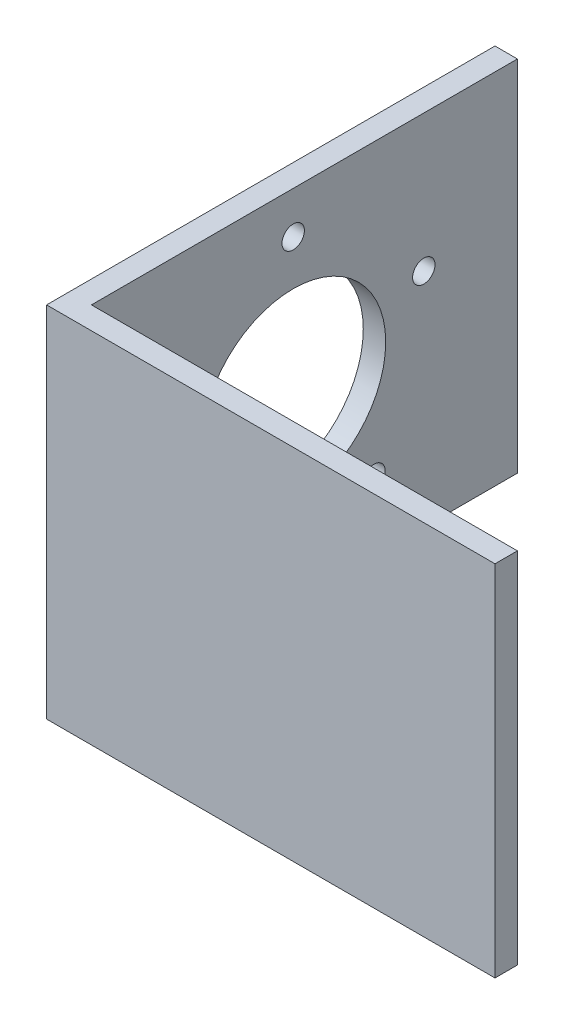
ISO-10303-21;
HEADER;
FILE_DESCRIPTION(('STEP AP214'),'2;1');
FILE_NAME('part.step','',(''),(''),'','','');
FILE_SCHEMA(('AUTOMOTIVE_DESIGN { 1 0 10303 214 1 1 1 1 }'));
ENDSEC;
DATA;
#1=APPLICATION_CONTEXT('core data for automotive mechanical design processes');
#2=APPLICATION_PROTOCOL_DEFINITION('international standard','automotive_design',2000,#1);
#3=PRODUCT_CONTEXT('',#1,'mechanical');
#4=PRODUCT('Part','Part','',(#3));
#5=PRODUCT_RELATED_PRODUCT_CATEGORY('part','',(#4));
#6=PRODUCT_DEFINITION_FORMATION('','',#4);
#7=PRODUCT_DEFINITION_CONTEXT('part definition',#1,'design');
#8=PRODUCT_DEFINITION('design','',#6,#7);
#9=PRODUCT_DEFINITION_SHAPE('','',#8);
#10=(LENGTH_UNIT() NAMED_UNIT(*) SI_UNIT(.MILLI.,.METRE.));
#11=(NAMED_UNIT(*) PLANE_ANGLE_UNIT() SI_UNIT($,.RADIAN.));
#12=(NAMED_UNIT(*) SI_UNIT($,.STERADIAN.) SOLID_ANGLE_UNIT());
#13=UNCERTAINTY_MEASURE_WITH_UNIT(LENGTH_MEASURE(1.E-05),#10,'distance_accuracy_value','');
#14=(GEOMETRIC_REPRESENTATION_CONTEXT(3) GLOBAL_UNCERTAINTY_ASSIGNED_CONTEXT((#13)) GLOBAL_UNIT_ASSIGNED_CONTEXT((#10,
#11,#12)) REPRESENTATION_CONTEXT('',''));
#15=CARTESIAN_POINT('',(0.,0.,0.));
#16=DIRECTION('',(0.,0.,1.));
#17=DIRECTION('',(1.,0.,0.));
#18=AXIS2_PLACEMENT_3D('',#15,#16,#17);
#19=CARTESIAN_POINT('',(0.,50.8,63.5));
#20=DIRECTION('',(1.,0.,0.));
#21=DIRECTION('',(0.,0.,-1.));
#22=AXIS2_PLACEMENT_3D('',#19,#20,#21);
#23=PLANE('',#22);
#24=CARTESIAN_POINT('',(0.,12.018829724971,36.9901543806545));
#25=DIRECTION('',(-1.,0.,0.));
#26=DIRECTION('',(0.,-0.95105651629515,0.309016994374958));
#27=AXIS2_PLACEMENT_3D('',#24,#25,#26);
#28=CIRCLE('',#27,3.175);
#29=CARTESIAN_POINT('',(0.,8.99922528573394,37.971283337795));
#30=VERTEX_POINT('',#29);
#31=EDGE_CURVE('E160',#30,#30,#28,.T.);
#32=ORIENTED_EDGE('',*,*,#31,.F.);
#33=EDGE_LOOP('',(#32));
#34=FACE_BOUND('',#33,.T.);
#35=CARTESIAN_POINT('',(0.,-31.4657047249704,22.8611726563507));
#36=DIRECTION('',(-1.,0.,0.));
#37=DIRECTION('',(0.,-0.58778525229248,-0.809016994374942));
#38=AXIS2_PLACEMENT_3D('',#35,#36,#37);
#39=CIRCLE('',#38,3.175);
#40=CARTESIAN_POINT('',(0.,-33.331922900999,20.2925436992102));
#41=VERTEX_POINT('',#40);
#42=EDGE_CURVE('E150',#41,#41,#39,.T.);
#43=ORIENTED_EDGE('',*,*,#42,.F.);
#44=EDGE_LOOP('',(#43));
#45=FACE_BOUND('',#44,.T.);
#46=CARTESIAN_POINT('',(0.,-31.4657047249708,-22.8611726563502));
#47=DIRECTION('',(-1.,0.,0.));
#48=DIRECTION('',(0.,0.587785252292469,-0.809016994374951));
#49=AXIS2_PLACEMENT_3D('',#46,#47,#48);
#50=CIRCLE('',#49,3.175);
#51=CARTESIAN_POINT('',(0.,-29.5994865489422,-25.4298016134907));
#52=VERTEX_POINT('',#51);
#53=EDGE_CURVE('E147',#52,#52,#50,.T.);
#54=ORIENTED_EDGE('',*,*,#53,.F.);
#55=EDGE_LOOP('',(#54));
#56=FACE_BOUND('',#55,.T.);
#57=CARTESIAN_POINT('',(0.,12.0188297249705,-36.9901543806547));
#58=DIRECTION('',(-1.,0.,0.));
#59=DIRECTION('',(0.,0.951056516295155,0.309016994374945));
#60=AXIS2_PLACEMENT_3D('',#57,#58,#59);
#61=CIRCLE('',#60,3.175);
#62=CARTESIAN_POINT('',(0.,15.0384341642076,-36.0090254235142));
#63=VERTEX_POINT('',#62);
#64=EDGE_CURVE('E144',#63,#63,#61,.T.);
#65=ORIENTED_EDGE('',*,*,#64,.F.);
#66=EDGE_LOOP('',(#65));
#67=FACE_BOUND('',#66,.T.);
#68=CARTESIAN_POINT('',(0.,38.89375,0.));
#69=DIRECTION('',(-1.,0.,0.));
#70=DIRECTION('',(0.,0.,1.));
#71=AXIS2_PLACEMENT_3D('',#68,#69,#70);
#72=CIRCLE('',#71,3.175);
#73=CARTESIAN_POINT('',(0.,38.89375,3.175));
#74=VERTEX_POINT('',#73);
#75=EDGE_CURVE('E140',#74,#74,#72,.T.);
#76=ORIENTED_EDGE('',*,*,#75,.F.);
#77=EDGE_LOOP('',(#76));
#78=FACE_BOUND('',#77,.T.);
#79=CARTESIAN_POINT('',(0.,0.,0.));
#80=DIRECTION('',(-1.,0.,0.));
#81=DIRECTION('',(0.,0.,1.));
#82=AXIS2_PLACEMENT_3D('',#79,#80,#81);
#83=CIRCLE('',#82,26.19375);
#84=CARTESIAN_POINT('',(0.,0.,26.19375));
#85=VERTEX_POINT('',#84);
#86=EDGE_CURVE('E136',#85,#85,#83,.T.);
#87=ORIENTED_EDGE('',*,*,#86,.F.);
#88=EDGE_LOOP('',(#87));
#89=FACE_BOUND('',#88,.T.);
#90=DIRECTION('',(0.,0.,1.));
#91=VECTOR('',#90,1.);
#92=CARTESIAN_POINT('',(0.,-50.8,63.5));
#93=LINE('',#92,#91);
#94=CARTESIAN_POINT('',(0.,-50.8,-63.5));
#95=VERTEX_POINT('',#94);
#96=CARTESIAN_POINT('',(0.,-50.8,63.5));
#97=VERTEX_POINT('',#96);
#98=EDGE_CURVE('E117',#95,#97,#93,.T.);
#99=ORIENTED_EDGE('',*,*,#98,.T.);
#100=DIRECTION('',(0.,-1.,0.));
#101=VECTOR('',#100,1.);
#102=CARTESIAN_POINT('',(0.,50.8,63.5));
#103=LINE('',#102,#101);
#104=CARTESIAN_POINT('',(0.,50.8,63.5));
#105=VERTEX_POINT('',#104);
#106=EDGE_CURVE('E11',#105,#97,#103,.T.);
#107=ORIENTED_EDGE('',*,*,#106,.F.);
#108=DIRECTION('',(0.,0.,1.));
#109=VECTOR('',#108,1.);
#110=CARTESIAN_POINT('',(0.,50.8,63.5));
#111=LINE('',#110,#109);
#112=CARTESIAN_POINT('',(0.,50.8,-63.5));
#113=VERTEX_POINT('',#112);
#114=EDGE_CURVE('E128',#113,#105,#111,.T.);
#115=ORIENTED_EDGE('',*,*,#114,.F.);
#116=DIRECTION('',(0.,-1.,0.));
#117=VECTOR('',#116,1.);
#118=CARTESIAN_POINT('',(0.,50.8,-63.5));
#119=LINE('',#118,#117);
#120=EDGE_CURVE('E113',#113,#95,#119,.T.);
#121=ORIENTED_EDGE('',*,*,#120,.T.);
#122=EDGE_LOOP('',(#99,#107,#115,#121));
#123=FACE_BOUND('',#122,.T.);
#124=ADVANCED_FACE('F31',(#34,#45,#56,#67,#78,#89,#123),#23,.F.);
#125=CARTESIAN_POINT('',(127.,50.8,63.5));
#126=DIRECTION('',(0.,0.,-1.));
#127=DIRECTION('',(-1.,0.,0.));
#128=AXIS2_PLACEMENT_3D('',#125,#126,#127);
#129=PLANE('',#128);
#130=DIRECTION('',(1.,0.,0.));
#131=VECTOR('',#130,1.);
#132=CARTESIAN_POINT('',(127.,-50.8,63.5));
#133=LINE('',#132,#131);
#134=CARTESIAN_POINT('',(127.,-50.8,63.5));
#135=VERTEX_POINT('',#134);
#136=EDGE_CURVE('E120',#97,#135,#133,.T.);
#137=ORIENTED_EDGE('',*,*,#136,.T.);
#138=DIRECTION('',(0.,-1.,0.));
#139=VECTOR('',#138,1.);
#140=CARTESIAN_POINT('',(127.,50.8,63.5));
#141=LINE('',#140,#139);
#142=CARTESIAN_POINT('',(127.,50.8,63.5));
#143=VERTEX_POINT('',#142);
#144=EDGE_CURVE('E40',#143,#135,#141,.T.);
#145=ORIENTED_EDGE('',*,*,#144,.F.);
#146=DIRECTION('',(1.,0.,0.));
#147=VECTOR('',#146,1.);
#148=CARTESIAN_POINT('',(127.,50.8,63.5));
#149=LINE('',#148,#147);
#150=EDGE_CURVE('E86',#105,#143,#149,.T.);
#151=ORIENTED_EDGE('',*,*,#150,.F.);
#152=ORIENTED_EDGE('',*,*,#106,.T.);
#153=EDGE_LOOP('',(#137,#145,#151,#152));
#154=FACE_BOUND('',#153,.T.);
#155=ADVANCED_FACE('F172',(#154),#129,.F.);
#156=CARTESIAN_POINT('',(127.,50.8,57.15));
#157=DIRECTION('',(-1.,0.,0.));
#158=DIRECTION('',(0.,0.,1.));
#159=AXIS2_PLACEMENT_3D('',#156,#157,#158);
#160=PLANE('',#159);
#161=DIRECTION('',(0.,0.,-1.));
#162=VECTOR('',#161,1.);
#163=CARTESIAN_POINT('',(127.,-50.8,57.15));
#164=LINE('',#163,#162);
#165=CARTESIAN_POINT('',(127.,-50.8,57.15));
#166=VERTEX_POINT('',#165);
#167=EDGE_CURVE('E123',#135,#166,#164,.T.);
#168=ORIENTED_EDGE('',*,*,#167,.T.);
#169=DIRECTION('',(0.,-1.,0.));
#170=VECTOR('',#169,1.);
#171=CARTESIAN_POINT('',(127.,50.8,57.15));
#172=LINE('',#171,#170);
#173=CARTESIAN_POINT('',(127.,50.8,57.15));
#174=VERTEX_POINT('',#173);
#175=EDGE_CURVE('E108',#174,#166,#172,.T.);
#176=ORIENTED_EDGE('',*,*,#175,.F.);
#177=DIRECTION('',(0.,0.,-1.));
#178=VECTOR('',#177,1.);
#179=CARTESIAN_POINT('',(127.,50.8,57.15));
#180=LINE('',#179,#178);
#181=EDGE_CURVE('E99',#143,#174,#180,.T.);
#182=ORIENTED_EDGE('',*,*,#181,.F.);
#183=ORIENTED_EDGE('',*,*,#144,.T.);
#184=EDGE_LOOP('',(#168,#176,#182,#183));
#185=FACE_BOUND('',#184,.T.);
#186=ADVANCED_FACE('F175',(#185),#160,.F.);
#187=CARTESIAN_POINT('',(6.35000000000001,50.8,57.15));
#188=DIRECTION('',(0.,0.,1.));
#189=DIRECTION('',(1.,0.,0.));
#190=AXIS2_PLACEMENT_3D('',#187,#188,#189);
#191=PLANE('',#190);
#192=DIRECTION('',(-1.,0.,0.));
#193=VECTOR('',#192,1.);
#194=CARTESIAN_POINT('',(6.35000000000001,-50.8,57.15));
#195=LINE('',#194,#193);
#196=CARTESIAN_POINT('',(6.35000000000001,-50.8,57.15));
#197=VERTEX_POINT('',#196);
#198=EDGE_CURVE('E107',#166,#197,#195,.T.);
#199=ORIENTED_EDGE('',*,*,#198,.T.);
#200=DIRECTION('',(0.,-1.,0.));
#201=VECTOR('',#200,1.);
#202=CARTESIAN_POINT('',(6.35000000000001,50.8,57.15));
#203=LINE('',#202,#201);
#204=CARTESIAN_POINT('',(6.35000000000001,50.8,57.15));
#205=VERTEX_POINT('',#204);
#206=EDGE_CURVE('E104',#205,#197,#203,.T.);
#207=ORIENTED_EDGE('',*,*,#206,.F.);
#208=DIRECTION('',(-1.,0.,0.));
#209=VECTOR('',#208,1.);
#210=CARTESIAN_POINT('',(6.35000000000001,50.8,57.15));
#211=LINE('',#210,#209);
#212=EDGE_CURVE('E93',#174,#205,#211,.T.);
#213=ORIENTED_EDGE('',*,*,#212,.F.);
#214=ORIENTED_EDGE('',*,*,#175,.T.);
#215=EDGE_LOOP('',(#199,#207,#213,#214));
#216=FACE_BOUND('',#215,.T.);
#217=ADVANCED_FACE('F105',(#216),#191,.F.);
#218=CARTESIAN_POINT('',(6.35,50.8,-63.5));
#219=DIRECTION('',(-1.,0.,0.));
#220=DIRECTION('',(0.,0.,1.));
#221=AXIS2_PLACEMENT_3D('',#218,#219,#220);
#222=PLANE('',#221);
#223=CARTESIAN_POINT('',(6.35000000000001,12.018829724971,36.9901543806545));
#224=DIRECTION('',(-1.,0.,0.));
#225=DIRECTION('',(0.,0.,1.));
#226=AXIS2_PLACEMENT_3D('',#223,#224,#225);
#227=CIRCLE('',#226,3.175);
#228=CARTESIAN_POINT('',(6.35000000000001,12.018829724971,40.1651543806545));
#229=VERTEX_POINT('',#228);
#230=EDGE_CURVE('E34',#229,#229,#227,.T.);
#231=ORIENTED_EDGE('',*,*,#230,.T.);
#232=EDGE_LOOP('',(#231));
#233=FACE_BOUND('',#232,.T.);
#234=CARTESIAN_POINT('',(6.35000000000001,-31.4657047249704,22.8611726563507));
#235=DIRECTION('',(-1.,0.,0.));
#236=DIRECTION('',(0.,0.,1.));
#237=AXIS2_PLACEMENT_3D('',#234,#235,#236);
#238=CIRCLE('',#237,3.175);
#239=CARTESIAN_POINT('',(6.35000000000001,-31.4657047249704,26.0361726563507));
#240=VERTEX_POINT('',#239);
#241=EDGE_CURVE('E148',#240,#240,#238,.T.);
#242=ORIENTED_EDGE('',*,*,#241,.T.);
#243=EDGE_LOOP('',(#242));
#244=FACE_BOUND('',#243,.T.);
#245=CARTESIAN_POINT('',(6.34999999999999,-31.4657047249708,-22.8611726563502));
#246=DIRECTION('',(-1.,0.,0.));
#247=DIRECTION('',(0.,0.,1.));
#248=AXIS2_PLACEMENT_3D('',#245,#246,#247);
#249=CIRCLE('',#248,3.175);
#250=CARTESIAN_POINT('',(6.34999999999999,-31.4657047249708,-19.6861726563502));
#251=VERTEX_POINT('',#250);
#252=EDGE_CURVE('E145',#251,#251,#249,.T.);
#253=ORIENTED_EDGE('',*,*,#252,.T.);
#254=EDGE_LOOP('',(#253));
#255=FACE_BOUND('',#254,.T.);
#256=CARTESIAN_POINT('',(6.34999999999999,12.0188297249705,-36.9901543806547));
#257=DIRECTION('',(-1.,0.,0.));
#258=DIRECTION('',(0.,0.,1.));
#259=AXIS2_PLACEMENT_3D('',#256,#257,#258);
#260=CIRCLE('',#259,3.175);
#261=CARTESIAN_POINT('',(6.34999999999999,12.0188297249705,-33.8151543806547));
#262=VERTEX_POINT('',#261);
#263=EDGE_CURVE('E141',#262,#262,#260,.T.);
#264=ORIENTED_EDGE('',*,*,#263,.T.);
#265=EDGE_LOOP('',(#264));
#266=FACE_BOUND('',#265,.T.);
#267=CARTESIAN_POINT('',(6.35000000000001,38.89375,0.));
#268=DIRECTION('',(-1.,0.,0.));
#269=DIRECTION('',(0.,0.,1.));
#270=AXIS2_PLACEMENT_3D('',#267,#268,#269);
#271=CIRCLE('',#270,3.175);
#272=CARTESIAN_POINT('',(6.35000000000001,38.89375,3.175));
#273=VERTEX_POINT('',#272);
#274=EDGE_CURVE('E137',#273,#273,#271,.T.);
#275=ORIENTED_EDGE('',*,*,#274,.T.);
#276=EDGE_LOOP('',(#275));
#277=FACE_BOUND('',#276,.T.);
#278=CARTESIAN_POINT('',(6.35000000000001,0.,0.));
#279=DIRECTION('',(-1.,0.,0.));
#280=DIRECTION('',(0.,0.,1.));
#281=AXIS2_PLACEMENT_3D('',#278,#279,#280);
#282=CIRCLE('',#281,26.19375);
#283=CARTESIAN_POINT('',(6.35000000000001,0.,26.19375));
#284=VERTEX_POINT('',#283);
#285=EDGE_CURVE('E121',#284,#284,#282,.T.);
#286=ORIENTED_EDGE('',*,*,#285,.T.);
#287=EDGE_LOOP('',(#286));
#288=FACE_BOUND('',#287,.T.);
#289=DIRECTION('',(0.,0.,-1.));
#290=VECTOR('',#289,1.);
#291=CARTESIAN_POINT('',(6.35,-50.8,-63.5));
#292=LINE('',#291,#290);
#293=CARTESIAN_POINT('',(6.35,-50.8,-63.5));
#294=VERTEX_POINT('',#293);
#295=EDGE_CURVE('E72',#197,#294,#292,.T.);
#296=ORIENTED_EDGE('',*,*,#295,.T.);
#297=DIRECTION('',(0.,-1.,0.));
#298=VECTOR('',#297,1.);
#299=CARTESIAN_POINT('',(6.35,50.8,-63.5));
#300=LINE('',#299,#298);
#301=CARTESIAN_POINT('',(6.35,50.8,-63.5));
#302=VERTEX_POINT('',#301);
#303=EDGE_CURVE('E109',#302,#294,#300,.T.);
#304=ORIENTED_EDGE('',*,*,#303,.F.);
#305=DIRECTION('',(0.,0.,-1.));
#306=VECTOR('',#305,1.);
#307=CARTESIAN_POINT('',(6.35,50.8,-63.5));
#308=LINE('',#307,#306);
#309=EDGE_CURVE('E97',#205,#302,#308,.T.);
#310=ORIENTED_EDGE('',*,*,#309,.F.);
#311=ORIENTED_EDGE('',*,*,#206,.T.);
#312=EDGE_LOOP('',(#296,#304,#310,#311));
#313=FACE_BOUND('',#312,.T.);
#314=ADVANCED_FACE('F111',(#233,#244,#255,#266,#277,#288,#313),#222,.F.);
#315=CARTESIAN_POINT('',(0.,50.8,-63.5));
#316=DIRECTION('',(0.,0.,1.));
#317=DIRECTION('',(1.,0.,0.));
#318=AXIS2_PLACEMENT_3D('',#315,#316,#317);
#319=PLANE('',#318);
#320=DIRECTION('',(-1.,0.,0.));
#321=VECTOR('',#320,1.);
#322=CARTESIAN_POINT('',(0.,-50.8,-63.5));
#323=LINE('',#322,#321);
#324=EDGE_CURVE('E78',#294,#95,#323,.T.);
#325=ORIENTED_EDGE('',*,*,#324,.T.);
#326=ORIENTED_EDGE('',*,*,#120,.F.);
#327=DIRECTION('',(-1.,0.,0.));
#328=VECTOR('',#327,1.);
#329=CARTESIAN_POINT('',(0.,50.8,-63.5));
#330=LINE('',#329,#328);
#331=EDGE_CURVE('E49',#302,#113,#330,.T.);
#332=ORIENTED_EDGE('',*,*,#331,.F.);
#333=ORIENTED_EDGE('',*,*,#303,.T.);
#334=EDGE_LOOP('',(#325,#326,#332,#333));
#335=FACE_BOUND('',#334,.T.);
#336=ADVANCED_FACE('F180',(#335),#319,.F.);
#337=CARTESIAN_POINT('',(0.,50.8,-63.5));
#338=DIRECTION('',(0.,-1.,0.));
#339=DIRECTION('',(0.,0.,-1.));
#340=AXIS2_PLACEMENT_3D('',#337,#338,#339);
#341=PLANE('',#340);
#342=ORIENTED_EDGE('',*,*,#114,.T.);
#343=ORIENTED_EDGE('',*,*,#150,.T.);
#344=ORIENTED_EDGE('',*,*,#181,.T.);
#345=ORIENTED_EDGE('',*,*,#212,.T.);
#346=ORIENTED_EDGE('',*,*,#309,.T.);
#347=ORIENTED_EDGE('',*,*,#331,.T.);
#348=EDGE_LOOP('',(#342,#343,#344,#345,#346,#347));
#349=FACE_BOUND('',#348,.T.);
#350=ADVANCED_FACE('F95',(#349),#341,.F.);
#351=CARTESIAN_POINT('',(0.,-50.8,-63.5));
#352=DIRECTION('',(0.,-1.,0.));
#353=DIRECTION('',(0.,0.,-1.));
#354=AXIS2_PLACEMENT_3D('',#351,#352,#353);
#355=PLANE('',#354);
#356=ORIENTED_EDGE('',*,*,#98,.F.);
#357=ORIENTED_EDGE('',*,*,#324,.F.);
#358=ORIENTED_EDGE('',*,*,#295,.F.);
#359=ORIENTED_EDGE('',*,*,#198,.F.);
#360=ORIENTED_EDGE('',*,*,#167,.F.);
#361=ORIENTED_EDGE('',*,*,#136,.F.);
#362=EDGE_LOOP('',(#356,#357,#358,#359,#360,#361));
#363=FACE_BOUND('',#362,.T.);
#364=ADVANCED_FACE('F178',(#363),#355,.T.);
#365=CARTESIAN_POINT('',(127.,0.,0.));
#366=DIRECTION('',(-1.,0.,0.));
#367=DIRECTION('',(0.,0.,1.));
#368=AXIS2_PLACEMENT_3D('',#365,#366,#367);
#369=CYLINDRICAL_SURFACE('',#368,26.19375);
#370=ORIENTED_EDGE('',*,*,#86,.T.);
#371=EDGE_LOOP('',(#370));
#372=FACE_BOUND('',#371,.T.);
#373=ORIENTED_EDGE('',*,*,#285,.F.);
#374=EDGE_LOOP('',(#373));
#375=FACE_BOUND('',#374,.T.);
#376=ADVANCED_FACE('F208',(#372,#375),#369,.F.);
#377=CARTESIAN_POINT('',(127.,38.89375,0.));
#378=DIRECTION('',(-1.,0.,0.));
#379=DIRECTION('',(0.,0.,1.));
#380=AXIS2_PLACEMENT_3D('',#377,#378,#379);
#381=CYLINDRICAL_SURFACE('',#380,3.175);
#382=ORIENTED_EDGE('',*,*,#75,.T.);
#383=EDGE_LOOP('',(#382));
#384=FACE_BOUND('',#383,.T.);
#385=ORIENTED_EDGE('',*,*,#274,.F.);
#386=EDGE_LOOP('',(#385));
#387=FACE_BOUND('',#386,.T.);
#388=ADVANCED_FACE('F211',(#384,#387),#381,.F.);
#389=CARTESIAN_POINT('',(127.,12.0188297249705,-36.9901543806547));
#390=DIRECTION('',(-1.,0.,0.));
#391=DIRECTION('',(0.,0.,1.));
#392=AXIS2_PLACEMENT_3D('',#389,#390,#391);
#393=CYLINDRICAL_SURFACE('',#392,3.175);
#394=ORIENTED_EDGE('',*,*,#64,.T.);
#395=EDGE_LOOP('',(#394));
#396=FACE_BOUND('',#395,.T.);
#397=ORIENTED_EDGE('',*,*,#263,.F.);
#398=EDGE_LOOP('',(#397));
#399=FACE_BOUND('',#398,.T.);
#400=ADVANCED_FACE('F219',(#396,#399),#393,.F.);
#401=CARTESIAN_POINT('',(127.,-31.4657047249708,-22.8611726563502));
#402=DIRECTION('',(-1.,0.,0.));
#403=DIRECTION('',(0.,0.,1.));
#404=AXIS2_PLACEMENT_3D('',#401,#402,#403);
#405=CYLINDRICAL_SURFACE('',#404,3.175);
#406=ORIENTED_EDGE('',*,*,#53,.T.);
#407=EDGE_LOOP('',(#406));
#408=FACE_BOUND('',#407,.T.);
#409=ORIENTED_EDGE('',*,*,#252,.F.);
#410=EDGE_LOOP('',(#409));
#411=FACE_BOUND('',#410,.T.);
#412=ADVANCED_FACE('F225',(#408,#411),#405,.F.);
#413=CARTESIAN_POINT('',(127.,-31.4657047249704,22.8611726563507));
#414=DIRECTION('',(-1.,0.,0.));
#415=DIRECTION('',(0.,0.,1.));
#416=AXIS2_PLACEMENT_3D('',#413,#414,#415);
#417=CYLINDRICAL_SURFACE('',#416,3.175);
#418=ORIENTED_EDGE('',*,*,#42,.T.);
#419=EDGE_LOOP('',(#418));
#420=FACE_BOUND('',#419,.T.);
#421=ORIENTED_EDGE('',*,*,#241,.F.);
#422=EDGE_LOOP('',(#421));
#423=FACE_BOUND('',#422,.T.);
#424=ADVANCED_FACE('F229',(#420,#423),#417,.F.);
#425=CARTESIAN_POINT('',(127.,12.018829724971,36.9901543806545));
#426=DIRECTION('',(-1.,0.,0.));
#427=DIRECTION('',(0.,0.,1.));
#428=AXIS2_PLACEMENT_3D('',#425,#426,#427);
#429=CYLINDRICAL_SURFACE('',#428,3.175);
#430=ORIENTED_EDGE('',*,*,#31,.T.);
#431=EDGE_LOOP('',(#430));
#432=FACE_BOUND('',#431,.T.);
#433=ORIENTED_EDGE('',*,*,#230,.F.);
#434=EDGE_LOOP('',(#433));
#435=FACE_BOUND('',#434,.T.);
#436=ADVANCED_FACE('F233',(#432,#435),#429,.F.);
#437=CLOSED_SHELL('',(#124,#155,#186,#217,#314,#336,#350,#364,#376,#388,#400,#412,#424,#436));
#438=MANIFOLD_SOLID_BREP('B2',#437);
#439=ADVANCED_BREP_SHAPE_REPRESENTATION('',(#18,#438),#14);
#440=SHAPE_DEFINITION_REPRESENTATION(#9,#439);
ENDSEC;
END-ISO-10303-21;
